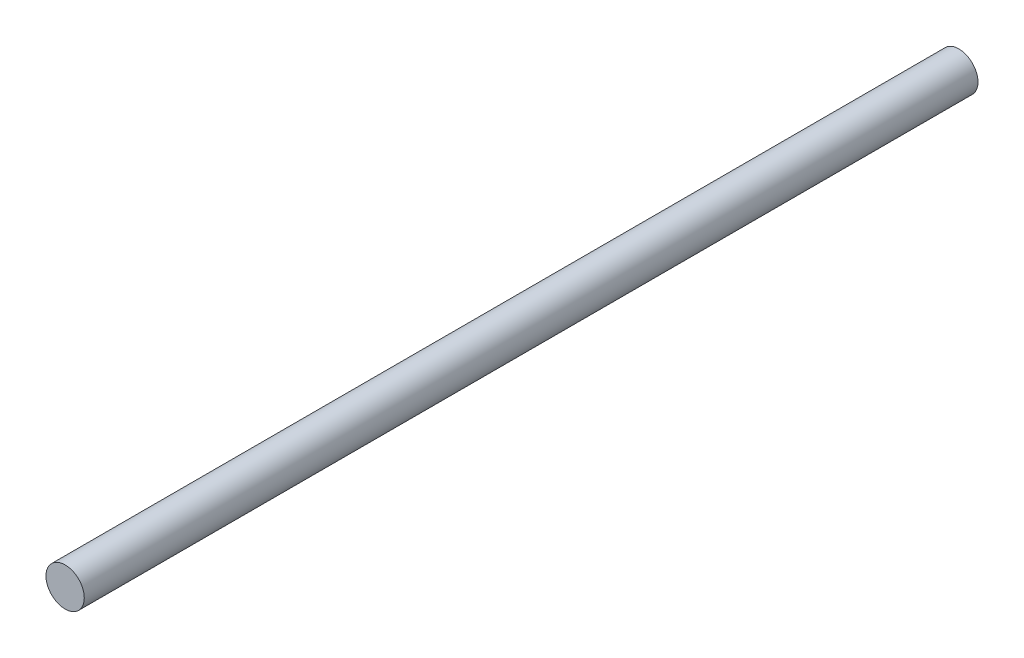
ISO-10303-21;
HEADER;
FILE_DESCRIPTION(('STEP AP214'),'2;1');
FILE_NAME('part.step','',(''),(''),'','','');
FILE_SCHEMA(('AUTOMOTIVE_DESIGN { 1 0 10303 214 1 1 1 1 }'));
ENDSEC;
DATA;
#1=APPLICATION_CONTEXT('core data for automotive mechanical design processes');
#2=APPLICATION_PROTOCOL_DEFINITION('international standard','automotive_design',2000,#1);
#3=PRODUCT_CONTEXT('',#1,'mechanical');
#4=PRODUCT('Part','Part','',(#3));
#5=PRODUCT_RELATED_PRODUCT_CATEGORY('part','',(#4));
#6=PRODUCT_DEFINITION_FORMATION('','',#4);
#7=PRODUCT_DEFINITION_CONTEXT('part definition',#1,'design');
#8=PRODUCT_DEFINITION('design','',#6,#7);
#9=PRODUCT_DEFINITION_SHAPE('','',#8);
#10=(LENGTH_UNIT() NAMED_UNIT(*) SI_UNIT(.MILLI.,.METRE.));
#11=(NAMED_UNIT(*) PLANE_ANGLE_UNIT() SI_UNIT($,.RADIAN.));
#12=(NAMED_UNIT(*) SI_UNIT($,.STERADIAN.) SOLID_ANGLE_UNIT());
#13=UNCERTAINTY_MEASURE_WITH_UNIT(LENGTH_MEASURE(1.E-05),#10,'distance_accuracy_value','');
#14=(GEOMETRIC_REPRESENTATION_CONTEXT(3) GLOBAL_UNCERTAINTY_ASSIGNED_CONTEXT((#13)) GLOBAL_UNIT_ASSIGNED_CONTEXT((#10,
#11,#12)) REPRESENTATION_CONTEXT('',''));
#15=CARTESIAN_POINT('',(0.,0.,0.));
#16=DIRECTION('',(0.,0.,1.));
#17=DIRECTION('',(1.,0.,0.));
#18=AXIS2_PLACEMENT_3D('',#15,#16,#17);
#19=CARTESIAN_POINT('',(0.,0.,140.));
#20=DIRECTION('',(0.,0.,-1.));
#21=DIRECTION('',(-1.,0.,0.));
#22=AXIS2_PLACEMENT_3D('',#19,#20,#21);
#23=CYLINDRICAL_SURFACE('',#22,3.);
#24=CARTESIAN_POINT('',(0.,0.,140.));
#25=DIRECTION('',(0.,0.,1.));
#26=DIRECTION('',(1.,0.,0.));
#27=AXIS2_PLACEMENT_3D('',#24,#25,#26);
#28=CIRCLE('',#27,3.);
#29=CARTESIAN_POINT('',(3.,0.,140.));
#30=VERTEX_POINT('',#29);
#31=EDGE_CURVE('E10',#30,#30,#28,.T.);
#32=ORIENTED_EDGE('',*,*,#31,.F.);
#33=EDGE_LOOP('',(#32));
#34=FACE_BOUND('',#33,.T.);
#35=CARTESIAN_POINT('',(0.,0.,0.));
#36=DIRECTION('',(0.,0.,1.));
#37=DIRECTION('',(1.,0.,0.));
#38=AXIS2_PLACEMENT_3D('',#35,#36,#37);
#39=CIRCLE('',#38,3.);
#40=CARTESIAN_POINT('',(3.,0.,0.));
#41=VERTEX_POINT('',#40);
#42=EDGE_CURVE('E34',#41,#41,#39,.T.);
#43=ORIENTED_EDGE('',*,*,#42,.T.);
#44=EDGE_LOOP('',(#43));
#45=FACE_BOUND('',#44,.T.);
#46=ADVANCED_FACE('F31',(#34,#45),#23,.T.);
#47=CARTESIAN_POINT('',(0.,0.,140.));
#48=DIRECTION('',(0.,0.,1.));
#49=DIRECTION('',(1.,0.,0.));
#50=AXIS2_PLACEMENT_3D('',#47,#48,#49);
#51=PLANE('',#50);
#52=ORIENTED_EDGE('',*,*,#31,.T.);
#53=EDGE_LOOP('',(#52));
#54=FACE_BOUND('',#53,.T.);
#55=ADVANCED_FACE('F46',(#54),#51,.T.);
#56=CARTESIAN_POINT('',(0.,0.,0.));
#57=DIRECTION('',(0.,0.,1.));
#58=DIRECTION('',(1.,0.,0.));
#59=AXIS2_PLACEMENT_3D('',#56,#57,#58);
#60=PLANE('',#59);
#61=ORIENTED_EDGE('',*,*,#42,.F.);
#62=EDGE_LOOP('',(#61));
#63=FACE_BOUND('',#62,.T.);
#64=ADVANCED_FACE('F44',(#63),#60,.F.);
#65=CLOSED_SHELL('',(#46,#55,#64));
#66=MANIFOLD_SOLID_BREP('B2',#65);
#67=ADVANCED_BREP_SHAPE_REPRESENTATION('',(#18,#66),#14);
#68=SHAPE_DEFINITION_REPRESENTATION(#9,#67);
ENDSEC;
END-ISO-10303-21;
